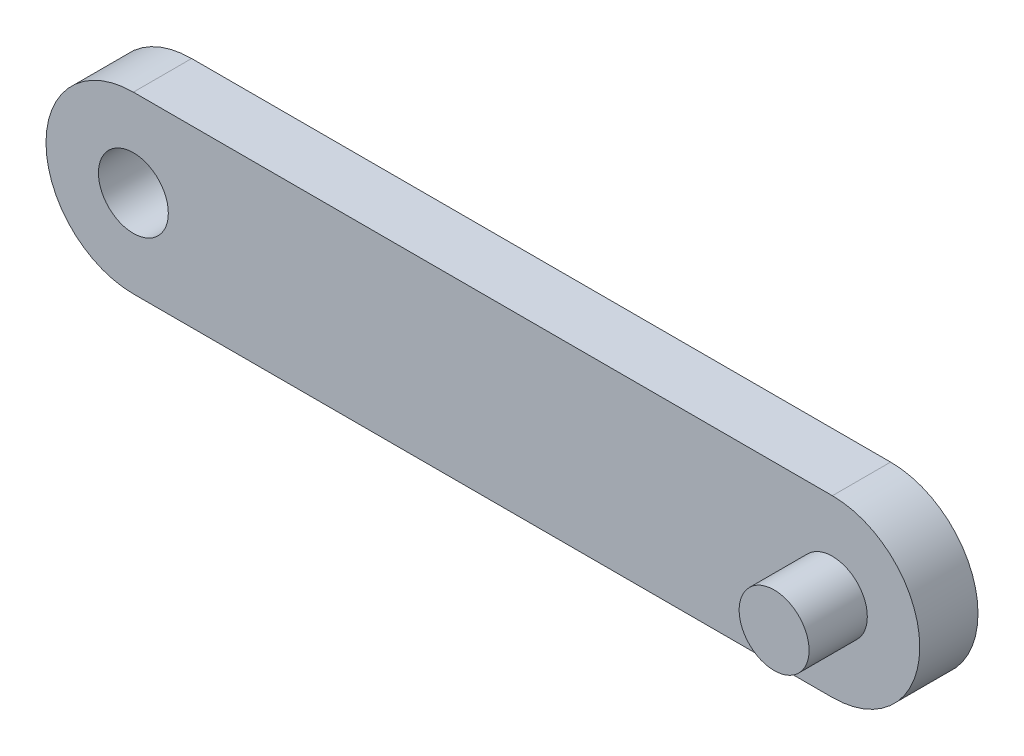
ISO-10303-21;
HEADER;
FILE_DESCRIPTION(('STEP AP214'),'2;1');
FILE_NAME('part.step','',(''),(''),'','','');
FILE_SCHEMA(('AUTOMOTIVE_DESIGN { 1 0 10303 214 1 1 1 1 }'));
ENDSEC;
DATA;
#1=APPLICATION_CONTEXT('core data for automotive mechanical design processes');
#2=APPLICATION_PROTOCOL_DEFINITION('international standard','automotive_design',2000,#1);
#3=PRODUCT_CONTEXT('',#1,'mechanical');
#4=PRODUCT('Part','Part','',(#3));
#5=PRODUCT_RELATED_PRODUCT_CATEGORY('part','',(#4));
#6=PRODUCT_DEFINITION_FORMATION('','',#4);
#7=PRODUCT_DEFINITION_CONTEXT('part definition',#1,'design');
#8=PRODUCT_DEFINITION('design','',#6,#7);
#9=PRODUCT_DEFINITION_SHAPE('','',#8);
#10=(LENGTH_UNIT() NAMED_UNIT(*) SI_UNIT(.MILLI.,.METRE.));
#11=(NAMED_UNIT(*) PLANE_ANGLE_UNIT() SI_UNIT($,.RADIAN.));
#12=(NAMED_UNIT(*) SI_UNIT($,.STERADIAN.) SOLID_ANGLE_UNIT());
#13=UNCERTAINTY_MEASURE_WITH_UNIT(LENGTH_MEASURE(1.E-05),#10,'distance_accuracy_value','');
#14=(GEOMETRIC_REPRESENTATION_CONTEXT(3) GLOBAL_UNCERTAINTY_ASSIGNED_CONTEXT((#13)) GLOBAL_UNIT_ASSIGNED_CONTEXT((#10,
#11,#12)) REPRESENTATION_CONTEXT('',''));
#15=CARTESIAN_POINT('',(0.,0.,0.));
#16=DIRECTION('',(0.,0.,1.));
#17=DIRECTION('',(1.,0.,0.));
#18=AXIS2_PLACEMENT_3D('',#15,#16,#17);
#19=CARTESIAN_POINT('',(0.,0.,10.));
#20=DIRECTION('',(0.,0.,1.));
#21=DIRECTION('',(1.,0.,0.));
#22=AXIS2_PLACEMENT_3D('',#19,#20,#21);
#23=PLANE('',#22);
#24=CARTESIAN_POINT('',(120.,0.,10.));
#25=DIRECTION('',(0.,0.,1.));
#26=DIRECTION('',(1.,0.,0.));
#27=AXIS2_PLACEMENT_3D('',#24,#25,#26);
#28=CIRCLE('',#27,6.00000000000002);
#29=CARTESIAN_POINT('',(126.,0.,10.));
#30=VERTEX_POINT('',#29);
#31=EDGE_CURVE('E117',#30,#30,#28,.T.);
#32=ORIENTED_EDGE('',*,*,#31,.F.);
#33=EDGE_LOOP('',(#32));
#34=FACE_BOUND('',#33,.T.);
#35=CARTESIAN_POINT('',(0.,0.,10.));
#36=DIRECTION('',(0.,0.,1.));
#37=DIRECTION('',(1.,0.,0.));
#38=AXIS2_PLACEMENT_3D('',#35,#36,#37);
#39=CIRCLE('',#38,15.);
#40=CARTESIAN_POINT('',(0.,15.,10.));
#41=VERTEX_POINT('',#40);
#42=CARTESIAN_POINT('',(0.,-15.,10.));
#43=VERTEX_POINT('',#42);
#44=EDGE_CURVE('E84',#41,#43,#39,.T.);
#45=ORIENTED_EDGE('',*,*,#44,.T.);
#46=DIRECTION('',(1.,0.,0.));
#47=VECTOR('',#46,1.);
#48=CARTESIAN_POINT('',(0.,-15.,10.));
#49=LINE('',#48,#47);
#50=CARTESIAN_POINT('',(120.,-15.,10.));
#51=VERTEX_POINT('',#50);
#52=EDGE_CURVE('E79',#43,#51,#49,.T.);
#53=ORIENTED_EDGE('',*,*,#52,.T.);
#54=CARTESIAN_POINT('',(120.,0.,10.));
#55=DIRECTION('',(0.,0.,1.));
#56=DIRECTION('',(1.,0.,0.));
#57=AXIS2_PLACEMENT_3D('',#54,#55,#56);
#58=CIRCLE('',#57,15.);
#59=CARTESIAN_POINT('',(120.,15.,10.));
#60=VERTEX_POINT('',#59);
#61=EDGE_CURVE('E82',#51,#60,#58,.T.);
#62=ORIENTED_EDGE('',*,*,#61,.T.);
#63=DIRECTION('',(-1.,0.,0.));
#64=VECTOR('',#63,1.);
#65=CARTESIAN_POINT('',(0.,15.,10.));
#66=LINE('',#65,#64);
#67=EDGE_CURVE('E49',#60,#41,#66,.T.);
#68=ORIENTED_EDGE('',*,*,#67,.T.);
#69=EDGE_LOOP('',(#45,#53,#62,#68));
#70=FACE_BOUND('',#69,.T.);
#71=CARTESIAN_POINT('',(0.,0.,10.));
#72=DIRECTION('',(0.,0.,1.));
#73=DIRECTION('',(1.,0.,0.));
#74=AXIS2_PLACEMENT_3D('',#71,#72,#73);
#75=CIRCLE('',#74,6.);
#76=CARTESIAN_POINT('',(6.,0.,10.));
#77=VERTEX_POINT('',#76);
#78=EDGE_CURVE('E99',#77,#77,#75,.T.);
#79=ORIENTED_EDGE('',*,*,#78,.F.);
#80=EDGE_LOOP('',(#79));
#81=FACE_BOUND('',#80,.T.);
#82=ADVANCED_FACE('F32',(#34,#70,#81),#23,.T.);
#83=CARTESIAN_POINT('',(0.,0.,0.));
#84=DIRECTION('',(0.,0.,1.));
#85=DIRECTION('',(1.,0.,0.));
#86=AXIS2_PLACEMENT_3D('',#83,#84,#85);
#87=PLANE('',#86);
#88=CARTESIAN_POINT('',(0.,0.,0.));
#89=DIRECTION('',(0.,0.,1.));
#90=DIRECTION('',(1.,0.,0.));
#91=AXIS2_PLACEMENT_3D('',#88,#89,#90);
#92=CIRCLE('',#91,15.);
#93=CARTESIAN_POINT('',(0.,15.,0.));
#94=VERTEX_POINT('',#93);
#95=CARTESIAN_POINT('',(0.,-15.,0.));
#96=VERTEX_POINT('',#95);
#97=EDGE_CURVE('E96',#94,#96,#92,.T.);
#98=ORIENTED_EDGE('',*,*,#97,.F.);
#99=DIRECTION('',(-1.,0.,0.));
#100=VECTOR('',#99,1.);
#101=CARTESIAN_POINT('',(0.,15.,0.));
#102=LINE('',#101,#100);
#103=CARTESIAN_POINT('',(120.,15.,0.));
#104=VERTEX_POINT('',#103);
#105=EDGE_CURVE('E72',#104,#94,#102,.T.);
#106=ORIENTED_EDGE('',*,*,#105,.F.);
#107=CARTESIAN_POINT('',(120.,0.,0.));
#108=DIRECTION('',(0.,0.,1.));
#109=DIRECTION('',(1.,0.,0.));
#110=AXIS2_PLACEMENT_3D('',#107,#108,#109);
#111=CIRCLE('',#110,15.);
#112=CARTESIAN_POINT('',(120.,-15.,0.));
#113=VERTEX_POINT('',#112);
#114=EDGE_CURVE('E66',#113,#104,#111,.T.);
#115=ORIENTED_EDGE('',*,*,#114,.F.);
#116=DIRECTION('',(1.,0.,0.));
#117=VECTOR('',#116,1.);
#118=CARTESIAN_POINT('',(0.,-15.,0.));
#119=LINE('',#118,#117);
#120=EDGE_CURVE('E88',#96,#113,#119,.T.);
#121=ORIENTED_EDGE('',*,*,#120,.F.);
#122=EDGE_LOOP('',(#98,#106,#115,#121));
#123=FACE_BOUND('',#122,.T.);
#124=CARTESIAN_POINT('',(0.,0.,0.));
#125=DIRECTION('',(0.,0.,1.));
#126=DIRECTION('',(1.,0.,0.));
#127=AXIS2_PLACEMENT_3D('',#124,#125,#126);
#128=CIRCLE('',#127,6.);
#129=CARTESIAN_POINT('',(6.,0.,0.));
#130=VERTEX_POINT('',#129);
#131=EDGE_CURVE('E111',#130,#130,#128,.T.);
#132=ORIENTED_EDGE('',*,*,#131,.T.);
#133=EDGE_LOOP('',(#132));
#134=FACE_BOUND('',#133,.T.);
#135=ADVANCED_FACE('F107',(#123,#134),#87,.F.);
#136=CARTESIAN_POINT('',(0.,0.,10.));
#137=DIRECTION('',(0.,0.,-1.));
#138=DIRECTION('',(-1.,0.,0.));
#139=AXIS2_PLACEMENT_3D('',#136,#137,#138);
#140=CYLINDRICAL_SURFACE('',#139,15.);
#141=ORIENTED_EDGE('',*,*,#97,.T.);
#142=DIRECTION('',(0.,0.,-1.));
#143=VECTOR('',#142,1.);
#144=CARTESIAN_POINT('',(0.,-15.,10.));
#145=LINE('',#144,#143);
#146=EDGE_CURVE('E11',#43,#96,#145,.T.);
#147=ORIENTED_EDGE('',*,*,#146,.F.);
#148=ORIENTED_EDGE('',*,*,#44,.F.);
#149=DIRECTION('',(0.,0.,-1.));
#150=VECTOR('',#149,1.);
#151=CARTESIAN_POINT('',(0.,15.,10.));
#152=LINE('',#151,#150);
#153=EDGE_CURVE('E92',#41,#94,#152,.T.);
#154=ORIENTED_EDGE('',*,*,#153,.T.);
#155=EDGE_LOOP('',(#141,#147,#148,#154));
#156=FACE_BOUND('',#155,.T.);
#157=ADVANCED_FACE('F34',(#156),#140,.T.);
#158=CARTESIAN_POINT('',(0.,-15.,10.));
#159=DIRECTION('',(0.,1.,0.));
#160=DIRECTION('',(0.,0.,1.));
#161=AXIS2_PLACEMENT_3D('',#158,#159,#160);
#162=PLANE('',#161);
#163=ORIENTED_EDGE('',*,*,#120,.T.);
#164=DIRECTION('',(0.,0.,-1.));
#165=VECTOR('',#164,1.);
#166=CARTESIAN_POINT('',(120.,-15.,10.));
#167=LINE('',#166,#165);
#168=EDGE_CURVE('E41',#51,#113,#167,.T.);
#169=ORIENTED_EDGE('',*,*,#168,.F.);
#170=ORIENTED_EDGE('',*,*,#52,.F.);
#171=ORIENTED_EDGE('',*,*,#146,.T.);
#172=EDGE_LOOP('',(#163,#169,#170,#171));
#173=FACE_BOUND('',#172,.T.);
#174=ADVANCED_FACE('F87',(#173),#162,.F.);
#175=CARTESIAN_POINT('',(120.,0.,10.));
#176=DIRECTION('',(0.,0.,-1.));
#177=DIRECTION('',(-1.,0.,0.));
#178=AXIS2_PLACEMENT_3D('',#175,#176,#177);
#179=CYLINDRICAL_SURFACE('',#178,15.);
#180=ORIENTED_EDGE('',*,*,#114,.T.);
#181=DIRECTION('',(0.,0.,-1.));
#182=VECTOR('',#181,1.);
#183=CARTESIAN_POINT('',(120.,15.,10.));
#184=LINE('',#183,#182);
#185=EDGE_CURVE('E89',#60,#104,#184,.T.);
#186=ORIENTED_EDGE('',*,*,#185,.F.);
#187=ORIENTED_EDGE('',*,*,#61,.F.);
#188=ORIENTED_EDGE('',*,*,#168,.T.);
#189=EDGE_LOOP('',(#180,#186,#187,#188));
#190=FACE_BOUND('',#189,.T.);
#191=ADVANCED_FACE('F90',(#190),#179,.T.);
#192=CARTESIAN_POINT('',(0.,15.,10.));
#193=DIRECTION('',(0.,-1.,0.));
#194=DIRECTION('',(0.,0.,-1.));
#195=AXIS2_PLACEMENT_3D('',#192,#193,#194);
#196=PLANE('',#195);
#197=ORIENTED_EDGE('',*,*,#105,.T.);
#198=ORIENTED_EDGE('',*,*,#153,.F.);
#199=ORIENTED_EDGE('',*,*,#67,.F.);
#200=ORIENTED_EDGE('',*,*,#185,.T.);
#201=EDGE_LOOP('',(#197,#198,#199,#200));
#202=FACE_BOUND('',#201,.T.);
#203=ADVANCED_FACE('F104',(#202),#196,.F.);
#204=CARTESIAN_POINT('',(0.,0.,10.));
#205=DIRECTION('',(0.,0.,-1.));
#206=DIRECTION('',(-1.,0.,0.));
#207=AXIS2_PLACEMENT_3D('',#204,#205,#206);
#208=CYLINDRICAL_SURFACE('',#207,6.);
#209=ORIENTED_EDGE('',*,*,#78,.T.);
#210=EDGE_LOOP('',(#209));
#211=FACE_BOUND('',#210,.T.);
#212=ORIENTED_EDGE('',*,*,#131,.F.);
#213=EDGE_LOOP('',(#212));
#214=FACE_BOUND('',#213,.T.);
#215=ADVANCED_FACE('F128',(#211,#214),#208,.F.);
#216=CARTESIAN_POINT('',(120.,0.,20.));
#217=DIRECTION('',(0.,0.,-1.));
#218=DIRECTION('',(-1.,0.,0.));
#219=AXIS2_PLACEMENT_3D('',#216,#217,#218);
#220=CYLINDRICAL_SURFACE('',#219,6.00000000000002);
#221=CARTESIAN_POINT('',(120.,0.,20.));
#222=DIRECTION('',(0.,0.,1.));
#223=DIRECTION('',(1.,0.,0.));
#224=AXIS2_PLACEMENT_3D('',#221,#222,#223);
#225=CIRCLE('',#224,6.00000000000002);
#226=CARTESIAN_POINT('',(126.,0.,20.));
#227=VERTEX_POINT('',#226);
#228=EDGE_CURVE('E114',#227,#227,#225,.T.);
#229=ORIENTED_EDGE('',*,*,#228,.F.);
#230=EDGE_LOOP('',(#229));
#231=FACE_BOUND('',#230,.T.);
#232=ORIENTED_EDGE('',*,*,#31,.T.);
#233=EDGE_LOOP('',(#232));
#234=FACE_BOUND('',#233,.T.);
#235=ADVANCED_FACE('F125',(#231,#234),#220,.T.);
#236=CARTESIAN_POINT('',(120.,0.,20.));
#237=DIRECTION('',(0.,0.,1.));
#238=DIRECTION('',(1.,0.,0.));
#239=AXIS2_PLACEMENT_3D('',#236,#237,#238);
#240=PLANE('',#239);
#241=ORIENTED_EDGE('',*,*,#228,.T.);
#242=EDGE_LOOP('',(#241));
#243=FACE_BOUND('',#242,.T.);
#244=ADVANCED_FACE('F123',(#243),#240,.T.);
#245=CLOSED_SHELL('',(#82,#135,#157,#174,#191,#203,#215,#235,#244));
#246=MANIFOLD_SOLID_BREP('B2',#245);
#247=ADVANCED_BREP_SHAPE_REPRESENTATION('',(#18,#246),#14);
#248=SHAPE_DEFINITION_REPRESENTATION(#9,#247);
ENDSEC;
END-ISO-10303-21;
